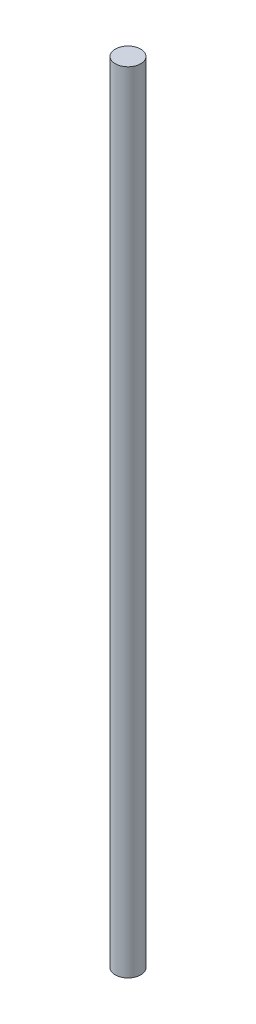
ISO-10303-21;
HEADER;
FILE_DESCRIPTION(('STEP AP214'),'2;1');
FILE_NAME('part.step','',(''),(''),'','','');
FILE_SCHEMA(('AUTOMOTIVE_DESIGN { 1 0 10303 214 1 1 1 1 }'));
ENDSEC;
DATA;
#1=APPLICATION_CONTEXT('core data for automotive mechanical design processes');
#2=APPLICATION_PROTOCOL_DEFINITION('international standard','automotive_design',2000,#1);
#3=PRODUCT_CONTEXT('',#1,'mechanical');
#4=PRODUCT('Part','Part','',(#3));
#5=PRODUCT_RELATED_PRODUCT_CATEGORY('part','',(#4));
#6=PRODUCT_DEFINITION_FORMATION('','',#4);
#7=PRODUCT_DEFINITION_CONTEXT('part definition',#1,'design');
#8=PRODUCT_DEFINITION('design','',#6,#7);
#9=PRODUCT_DEFINITION_SHAPE('','',#8);
#10=(LENGTH_UNIT() NAMED_UNIT(*) SI_UNIT(.MILLI.,.METRE.));
#11=(NAMED_UNIT(*) PLANE_ANGLE_UNIT() SI_UNIT($,.RADIAN.));
#12=(NAMED_UNIT(*) SI_UNIT($,.STERADIAN.) SOLID_ANGLE_UNIT());
#13=UNCERTAINTY_MEASURE_WITH_UNIT(LENGTH_MEASURE(1.E-05),#10,'distance_accuracy_value','');
#14=(GEOMETRIC_REPRESENTATION_CONTEXT(3) GLOBAL_UNCERTAINTY_ASSIGNED_CONTEXT((#13)) GLOBAL_UNIT_ASSIGNED_CONTEXT((#10,
#11,#12)) REPRESENTATION_CONTEXT('',''));
#15=CARTESIAN_POINT('',(0.,0.,0.));
#16=DIRECTION('',(0.,0.,1.));
#17=DIRECTION('',(1.,0.,0.));
#18=AXIS2_PLACEMENT_3D('',#15,#16,#17);
#19=CARTESIAN_POINT('',(0.,196.85,0.));
#20=DIRECTION('',(0.,-1.,0.));
#21=DIRECTION('',(0.,0.,-1.));
#22=AXIS2_PLACEMENT_3D('',#19,#20,#21);
#23=CYLINDRICAL_SURFACE('',#22,3.175);
#24=CARTESIAN_POINT('',(0.,196.85,0.));
#25=DIRECTION('',(0.,1.,0.));
#26=DIRECTION('',(0.,0.,1.));
#27=AXIS2_PLACEMENT_3D('',#24,#25,#26);
#28=CIRCLE('',#27,3.175);
#29=CARTESIAN_POINT('',(0.,196.85,3.175));
#30=VERTEX_POINT('',#29);
#31=EDGE_CURVE('E10',#30,#30,#28,.T.);
#32=ORIENTED_EDGE('',*,*,#31,.F.);
#33=EDGE_LOOP('',(#32));
#34=FACE_BOUND('',#33,.T.);
#35=CARTESIAN_POINT('',(0.,0.,0.));
#36=DIRECTION('',(0.,1.,0.));
#37=DIRECTION('',(0.,0.,1.));
#38=AXIS2_PLACEMENT_3D('',#35,#36,#37);
#39=CIRCLE('',#38,3.175);
#40=CARTESIAN_POINT('',(0.,0.,3.175));
#41=VERTEX_POINT('',#40);
#42=EDGE_CURVE('E44',#41,#41,#39,.T.);
#43=ORIENTED_EDGE('',*,*,#42,.T.);
#44=EDGE_LOOP('',(#43));
#45=FACE_BOUND('',#44,.T.);
#46=ADVANCED_FACE('F41',(#34,#45),#23,.T.);
#47=CARTESIAN_POINT('',(0.,196.85,0.));
#48=DIRECTION('',(0.,1.,0.));
#49=DIRECTION('',(0.,0.,1.));
#50=AXIS2_PLACEMENT_3D('',#47,#48,#49);
#51=PLANE('',#50);
#52=ORIENTED_EDGE('',*,*,#31,.T.);
#53=EDGE_LOOP('',(#52));
#54=FACE_BOUND('',#53,.T.);
#55=ADVANCED_FACE('F58',(#54),#51,.T.);
#56=CARTESIAN_POINT('',(0.,0.,0.));
#57=DIRECTION('',(0.,1.,0.));
#58=DIRECTION('',(0.,0.,1.));
#59=AXIS2_PLACEMENT_3D('',#56,#57,#58);
#60=PLANE('',#59);
#61=ORIENTED_EDGE('',*,*,#42,.F.);
#62=EDGE_LOOP('',(#61));
#63=FACE_BOUND('',#62,.T.);
#64=ADVANCED_FACE('F56',(#63),#60,.F.);
#65=CLOSED_SHELL('',(#46,#55,#64));
#66=MANIFOLD_SOLID_BREP('B2',#65);
#67=ADVANCED_BREP_SHAPE_REPRESENTATION('',(#18,#66),#14);
#68=SHAPE_DEFINITION_REPRESENTATION(#9,#67);
ENDSEC;
END-ISO-10303-21;
